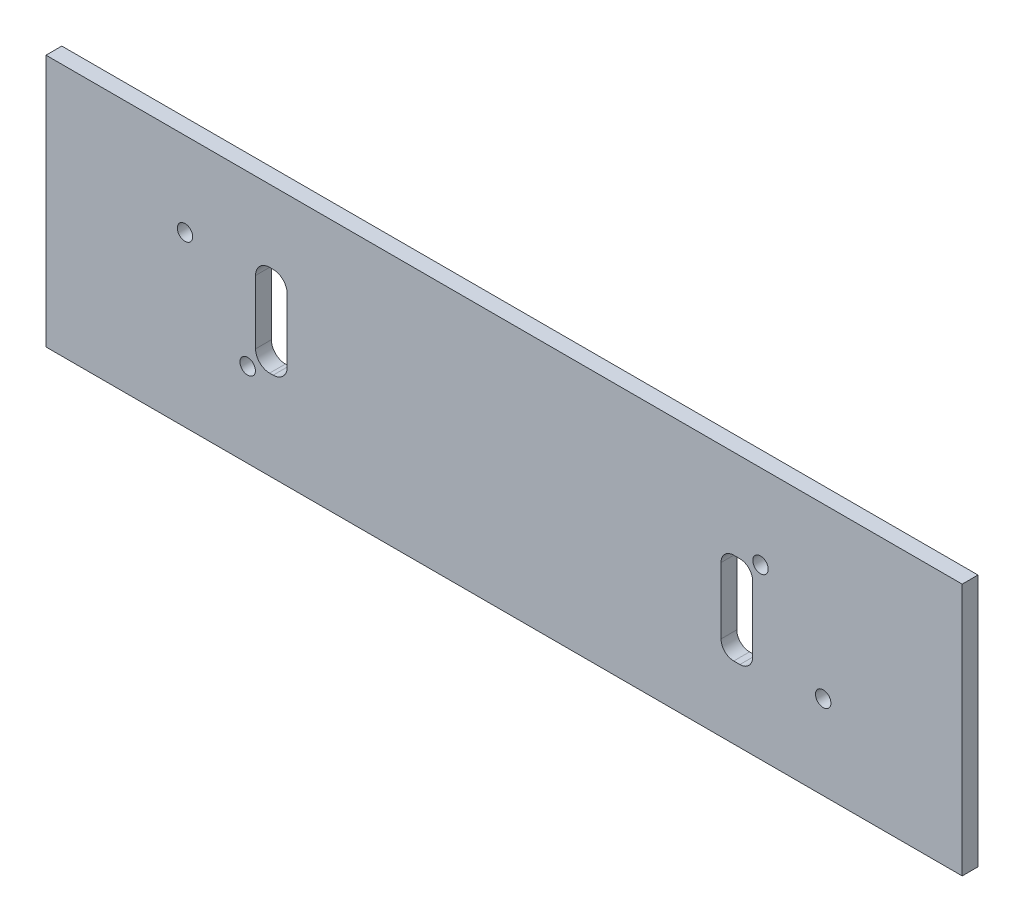
ISO-10303-21;
HEADER;
FILE_DESCRIPTION(('STEP AP214'),'2;1');
FILE_NAME('part.step','',(''),(''),'','','');
FILE_SCHEMA(('AUTOMOTIVE_DESIGN { 1 0 10303 214 1 1 1 1 }'));
ENDSEC;
DATA;
#1=APPLICATION_CONTEXT('core data for automotive mechanical design processes');
#2=APPLICATION_PROTOCOL_DEFINITION('international standard','automotive_design',2000,#1);
#3=PRODUCT_CONTEXT('',#1,'mechanical');
#4=PRODUCT('Part','Part','',(#3));
#5=PRODUCT_RELATED_PRODUCT_CATEGORY('part','',(#4));
#6=PRODUCT_DEFINITION_FORMATION('','',#4);
#7=PRODUCT_DEFINITION_CONTEXT('part definition',#1,'design');
#8=PRODUCT_DEFINITION('design','',#6,#7);
#9=PRODUCT_DEFINITION_SHAPE('','',#8);
#10=(LENGTH_UNIT() NAMED_UNIT(*) SI_UNIT(.MILLI.,.METRE.));
#11=(NAMED_UNIT(*) PLANE_ANGLE_UNIT() SI_UNIT($,.RADIAN.));
#12=(NAMED_UNIT(*) SI_UNIT($,.STERADIAN.) SOLID_ANGLE_UNIT());
#13=UNCERTAINTY_MEASURE_WITH_UNIT(LENGTH_MEASURE(1.E-05),#10,'distance_accuracy_value','');
#14=(GEOMETRIC_REPRESENTATION_CONTEXT(3) GLOBAL_UNCERTAINTY_ASSIGNED_CONTEXT((#13)) GLOBAL_UNIT_ASSIGNED_CONTEXT((#10,
#11,#12)) REPRESENTATION_CONTEXT('',''));
#15=CARTESIAN_POINT('',(0.,0.,0.));
#16=DIRECTION('',(0.,0.,1.));
#17=DIRECTION('',(1.,0.,0.));
#18=AXIS2_PLACEMENT_3D('',#15,#16,#17);
#19=CARTESIAN_POINT('',(92.075,-25.4,1.5875));
#20=DIRECTION('',(-1.,0.,0.));
#21=DIRECTION('',(0.,0.,1.));
#22=AXIS2_PLACEMENT_3D('',#19,#20,#21);
#23=PLANE('',#22);
#24=DIRECTION('',(0.,1.,0.));
#25=VECTOR('',#24,1.);
#26=CARTESIAN_POINT('',(92.075,-25.4,-1.5875));
#27=LINE('',#26,#25);
#28=CARTESIAN_POINT('',(92.075,-25.4,-1.5875));
#29=VERTEX_POINT('',#28);
#30=CARTESIAN_POINT('',(92.075,25.4,-1.5875));
#31=VERTEX_POINT('',#30);
#32=EDGE_CURVE('E330',#29,#31,#27,.T.);
#33=ORIENTED_EDGE('',*,*,#32,.T.);
#34=DIRECTION('',(0.,0.,-1.));
#35=VECTOR('',#34,1.);
#36=CARTESIAN_POINT('',(92.075,25.4,1.5875));
#37=LINE('',#36,#35);
#38=CARTESIAN_POINT('',(92.075,25.4,1.5875));
#39=VERTEX_POINT('',#38);
#40=EDGE_CURVE('E11',#39,#31,#37,.T.);
#41=ORIENTED_EDGE('',*,*,#40,.F.);
#42=DIRECTION('',(0.,1.,0.));
#43=VECTOR('',#42,1.);
#44=CARTESIAN_POINT('',(92.075,-25.4,1.5875));
#45=LINE('',#44,#43);
#46=CARTESIAN_POINT('',(92.075,-25.4,1.5875));
#47=VERTEX_POINT('',#46);
#48=EDGE_CURVE('E331',#47,#39,#45,.T.);
#49=ORIENTED_EDGE('',*,*,#48,.F.);
#50=DIRECTION('',(0.,0.,-1.));
#51=VECTOR('',#50,1.);
#52=CARTESIAN_POINT('',(92.075,-25.4,1.5875));
#53=LINE('',#52,#51);
#54=EDGE_CURVE('E341',#47,#29,#53,.T.);
#55=ORIENTED_EDGE('',*,*,#54,.T.);
#56=EDGE_LOOP('',(#33,#41,#49,#55));
#57=FACE_BOUND('',#56,.T.);
#58=ADVANCED_FACE('F35',(#57),#23,.F.);
#59=CARTESIAN_POINT('',(-92.075,25.4,1.5875));
#60=DIRECTION('',(0.,-1.,0.));
#61=DIRECTION('',(0.,0.,-1.));
#62=AXIS2_PLACEMENT_3D('',#59,#60,#61);
#63=PLANE('',#62);
#64=DIRECTION('',(-1.,0.,0.));
#65=VECTOR('',#64,1.);
#66=CARTESIAN_POINT('',(-92.075,25.4,-1.5875));
#67=LINE('',#66,#65);
#68=CARTESIAN_POINT('',(-92.075,25.4,-1.5875));
#69=VERTEX_POINT('',#68);
#70=EDGE_CURVE('E344',#31,#69,#67,.T.);
#71=ORIENTED_EDGE('',*,*,#70,.T.);
#72=DIRECTION('',(0.,0.,-1.));
#73=VECTOR('',#72,1.);
#74=CARTESIAN_POINT('',(-92.075,25.4,1.5875));
#75=LINE('',#74,#73);
#76=CARTESIAN_POINT('',(-92.075,25.4,1.5875));
#77=VERTEX_POINT('',#76);
#78=EDGE_CURVE('E42',#77,#69,#75,.T.);
#79=ORIENTED_EDGE('',*,*,#78,.F.);
#80=DIRECTION('',(-1.,0.,0.));
#81=VECTOR('',#80,1.);
#82=CARTESIAN_POINT('',(-92.075,25.4,1.5875));
#83=LINE('',#82,#81);
#84=EDGE_CURVE('E334',#39,#77,#83,.T.);
#85=ORIENTED_EDGE('',*,*,#84,.F.);
#86=ORIENTED_EDGE('',*,*,#40,.T.);
#87=EDGE_LOOP('',(#71,#79,#85,#86));
#88=FACE_BOUND('',#87,.T.);
#89=ADVANCED_FACE('F373',(#88),#63,.F.);
#90=CARTESIAN_POINT('',(-92.075,-25.4,1.5875));
#91=DIRECTION('',(1.,0.,0.));
#92=DIRECTION('',(0.,0.,-1.));
#93=AXIS2_PLACEMENT_3D('',#90,#91,#92);
#94=PLANE('',#93);
#95=DIRECTION('',(0.,-1.,0.));
#96=VECTOR('',#95,1.);
#97=CARTESIAN_POINT('',(-92.075,-25.4,-1.5875));
#98=LINE('',#97,#96);
#99=CARTESIAN_POINT('',(-92.075,-25.4,-1.5875));
#100=VERTEX_POINT('',#99);
#101=EDGE_CURVE('E346',#69,#100,#98,.T.);
#102=ORIENTED_EDGE('',*,*,#101,.T.);
#103=DIRECTION('',(0.,0.,-1.));
#104=VECTOR('',#103,1.);
#105=CARTESIAN_POINT('',(-92.075,-25.4,1.5875));
#106=LINE('',#105,#104);
#107=CARTESIAN_POINT('',(-92.075,-25.4,1.5875));
#108=VERTEX_POINT('',#107);
#109=EDGE_CURVE('E351',#108,#100,#106,.T.);
#110=ORIENTED_EDGE('',*,*,#109,.F.);
#111=DIRECTION('',(0.,-1.,0.));
#112=VECTOR('',#111,1.);
#113=CARTESIAN_POINT('',(-92.075,-25.4,1.5875));
#114=LINE('',#113,#112);
#115=EDGE_CURVE('E337',#77,#108,#114,.T.);
#116=ORIENTED_EDGE('',*,*,#115,.F.);
#117=ORIENTED_EDGE('',*,*,#78,.T.);
#118=EDGE_LOOP('',(#102,#110,#116,#117));
#119=FACE_BOUND('',#118,.T.);
#120=ADVANCED_FACE('F358',(#119),#94,.F.);
#121=CARTESIAN_POINT('',(-92.075,-25.4,1.5875));
#122=DIRECTION('',(0.,1.,0.));
#123=DIRECTION('',(0.,0.,1.));
#124=AXIS2_PLACEMENT_3D('',#121,#122,#123);
#125=PLANE('',#124);
#126=DIRECTION('',(1.,0.,0.));
#127=VECTOR('',#126,1.);
#128=CARTESIAN_POINT('',(-92.075,-25.4,-1.5875));
#129=LINE('',#128,#127);
#130=EDGE_CURVE('E335',#100,#29,#129,.T.);
#131=ORIENTED_EDGE('',*,*,#130,.T.);
#132=ORIENTED_EDGE('',*,*,#54,.F.);
#133=DIRECTION('',(1.,0.,0.));
#134=VECTOR('',#133,1.);
#135=CARTESIAN_POINT('',(-92.075,-25.4,1.5875));
#136=LINE('',#135,#134);
#137=EDGE_CURVE('E339',#108,#47,#136,.T.);
#138=ORIENTED_EDGE('',*,*,#137,.F.);
#139=ORIENTED_EDGE('',*,*,#109,.T.);
#140=EDGE_LOOP('',(#131,#132,#138,#139));
#141=FACE_BOUND('',#140,.T.);
#142=ADVANCED_FACE('F366',(#141),#125,.F.);
#143=CARTESIAN_POINT('',(0.,0.,1.5875));
#144=DIRECTION('',(0.,0.,-1.));
#145=DIRECTION('',(-1.,0.,0.));
#146=AXIS2_PLACEMENT_3D('',#143,#144,#145);
#147=PLANE('',#146);
#148=DIRECTION('',(0.,-1.,0.));
#149=VECTOR('',#148,1.);
#150=CARTESIAN_POINT('',(49.95,0.,1.5875));
#151=LINE('',#150,#149);
#152=CARTESIAN_POINT('',(49.95,4.91823249157205,1.5875));
#153=VERTEX_POINT('',#152);
#154=CARTESIAN_POINT('',(49.95,-8.37823249157208,1.5875));
#155=VERTEX_POINT('',#154);
#156=EDGE_CURVE('E324',#153,#155,#151,.T.);
#157=ORIENTED_EDGE('',*,*,#156,.T.);
#158=CARTESIAN_POINT('',(47.3907324915721,-8.37823249157208,1.5875));
#159=DIRECTION('',(0.,0.,-1.));
#160=DIRECTION('',(-1.,0.,0.));
#161=AXIS2_PLACEMENT_3D('',#158,#159,#160);
#162=CIRCLE('',#161,2.55926750842794);
#163=CARTESIAN_POINT('',(47.3907324915721,-10.9375,1.5875));
#164=VERTEX_POINT('',#163);
#165=EDGE_CURVE('E327',#155,#164,#162,.T.);
#166=ORIENTED_EDGE('',*,*,#165,.T.);
#167=DIRECTION('',(-1.,0.,0.));
#168=VECTOR('',#167,1.);
#169=CARTESIAN_POINT('',(0.,-10.9375,1.5875));
#170=LINE('',#169,#168);
#171=CARTESIAN_POINT('',(46.159267508428,-10.9375,1.5875));
#172=VERTEX_POINT('',#171);
#173=EDGE_CURVE('E306',#164,#172,#170,.T.);
#174=ORIENTED_EDGE('',*,*,#173,.T.);
#175=CARTESIAN_POINT('',(46.159267508428,-8.37823249157208,1.5875));
#176=DIRECTION('',(0.,0.,-1.));
#177=DIRECTION('',(-1.,0.,0.));
#178=AXIS2_PLACEMENT_3D('',#175,#176,#177);
#179=CIRCLE('',#178,2.55926750842794);
#180=CARTESIAN_POINT('',(43.6,-8.37823249157208,1.5875));
#181=VERTEX_POINT('',#180);
#182=EDGE_CURVE('E309',#172,#181,#179,.T.);
#183=ORIENTED_EDGE('',*,*,#182,.T.);
#184=DIRECTION('',(0.,1.,0.));
#185=VECTOR('',#184,1.);
#186=CARTESIAN_POINT('',(43.6,0.,1.5875));
#187=LINE('',#186,#185);
#188=CARTESIAN_POINT('',(43.6,4.91823249157205,1.5875));
#189=VERTEX_POINT('',#188);
#190=EDGE_CURVE('E312',#181,#189,#187,.T.);
#191=ORIENTED_EDGE('',*,*,#190,.T.);
#192=CARTESIAN_POINT('',(46.159267508428,4.91823249157205,1.5875));
#193=DIRECTION('',(0.,0.,-1.));
#194=DIRECTION('',(-1.,0.,0.));
#195=AXIS2_PLACEMENT_3D('',#192,#193,#194);
#196=CIRCLE('',#195,2.55926750842794);
#197=CARTESIAN_POINT('',(46.159267508428,7.47749999999998,1.5875));
#198=VERTEX_POINT('',#197);
#199=EDGE_CURVE('E315',#189,#198,#196,.T.);
#200=ORIENTED_EDGE('',*,*,#199,.T.);
#201=DIRECTION('',(1.,0.,0.));
#202=VECTOR('',#201,1.);
#203=CARTESIAN_POINT('',(0.,7.47749999999998,1.5875));
#204=LINE('',#203,#202);
#205=CARTESIAN_POINT('',(47.3907324915721,7.47749999999998,1.5875));
#206=VERTEX_POINT('',#205);
#207=EDGE_CURVE('E318',#198,#206,#204,.T.);
#208=ORIENTED_EDGE('',*,*,#207,.T.);
#209=CARTESIAN_POINT('',(47.3907324915721,4.91823249157205,1.5875));
#210=DIRECTION('',(0.,0.,-1.));
#211=DIRECTION('',(-1.,0.,0.));
#212=AXIS2_PLACEMENT_3D('',#209,#210,#211);
#213=CIRCLE('',#212,2.55926750842794);
#214=EDGE_CURVE('E321',#206,#153,#213,.T.);
#215=ORIENTED_EDGE('',*,*,#214,.T.);
#216=EDGE_LOOP('',(#157,#166,#174,#183,#191,#200,#208,#215));
#217=FACE_BOUND('',#216,.T.);
#218=CARTESIAN_POINT('',(-51.535,-8.49,1.5875));
#219=DIRECTION('',(0.,0.,-1.));
#220=DIRECTION('',(-1.,0.,0.));
#221=AXIS2_PLACEMENT_3D('',#218,#219,#220);
#222=CIRCLE('',#221,1.55);
#223=CARTESIAN_POINT('',(-53.085,-8.49,1.5875));
#224=VERTEX_POINT('',#223);
#225=EDGE_CURVE('E303',#224,#224,#222,.T.);
#226=ORIENTED_EDGE('',*,*,#225,.T.);
#227=EDGE_LOOP('',(#226));
#228=FACE_BOUND('',#227,.T.);
#229=CARTESIAN_POINT('',(-64.135,8.51,1.5875));
#230=DIRECTION('',(0.,0.,-1.));
#231=DIRECTION('',(-1.,0.,0.));
#232=AXIS2_PLACEMENT_3D('',#229,#230,#231);
#233=CIRCLE('',#232,1.55000000000001);
#234=CARTESIAN_POINT('',(-65.685,8.51,1.5875));
#235=VERTEX_POINT('',#234);
#236=EDGE_CURVE('E300',#235,#235,#233,.T.);
#237=ORIENTED_EDGE('',*,*,#236,.T.);
#238=EDGE_LOOP('',(#237));
#239=FACE_BOUND('',#238,.T.);
#240=CARTESIAN_POINT('',(64.135,-8.51000000000002,1.5875));
#241=DIRECTION('',(0.,0.,-1.));
#242=DIRECTION('',(-1.,0.,0.));
#243=AXIS2_PLACEMENT_3D('',#240,#241,#242);
#244=CIRCLE('',#243,1.55000000000001);
#245=CARTESIAN_POINT('',(62.585,-8.51000000000002,1.5875));
#246=VERTEX_POINT('',#245);
#247=EDGE_CURVE('E297',#246,#246,#244,.T.);
#248=ORIENTED_EDGE('',*,*,#247,.T.);
#249=EDGE_LOOP('',(#248));
#250=FACE_BOUND('',#249,.T.);
#251=DIRECTION('',(0.,-1.,0.));
#252=VECTOR('',#251,1.);
#253=CARTESIAN_POINT('',(-43.6,0.,1.5875));
#254=LINE('',#253,#252);
#255=CARTESIAN_POINT('',(-43.6,8.11818153718454,1.5875));
#256=VERTEX_POINT('',#255);
#257=CARTESIAN_POINT('',(-43.6,-4.65818153718455,1.5875));
#258=VERTEX_POINT('',#257);
#259=EDGE_CURVE('E291',#256,#258,#254,.T.);
#260=ORIENTED_EDGE('',*,*,#259,.T.);
#261=CARTESIAN_POINT('',(-46.4193184628155,-4.65818153718455,1.5875));
#262=DIRECTION('',(0.,0.,-1.));
#263=DIRECTION('',(-1.,0.,0.));
#264=AXIS2_PLACEMENT_3D('',#261,#262,#263);
#265=CIRCLE('',#264,2.81931846281545);
#266=CARTESIAN_POINT('',(-46.4193184628155,-7.47750000000001,1.5875));
#267=VERTEX_POINT('',#266);
#268=EDGE_CURVE('E294',#258,#267,#265,.T.);
#269=ORIENTED_EDGE('',*,*,#268,.T.);
#270=DIRECTION('',(-1.,0.,0.));
#271=VECTOR('',#270,1.);
#272=CARTESIAN_POINT('',(0.,-7.47750000000001,1.5875));
#273=LINE('',#272,#271);
#274=CARTESIAN_POINT('',(-47.1306815371846,-7.47750000000001,1.5875));
#275=VERTEX_POINT('',#274);
#276=EDGE_CURVE('E276',#267,#275,#273,.T.);
#277=ORIENTED_EDGE('',*,*,#276,.T.);
#278=CARTESIAN_POINT('',(-47.1306815371846,-4.65818153718455,1.5875));
#279=DIRECTION('',(0.,0.,-1.));
#280=DIRECTION('',(-1.,0.,0.));
#281=AXIS2_PLACEMENT_3D('',#278,#279,#280);
#282=CIRCLE('',#281,2.81931846281545);
#283=CARTESIAN_POINT('',(-49.95,-4.65818153718455,1.5875));
#284=VERTEX_POINT('',#283);
#285=EDGE_CURVE('E176',#275,#284,#282,.T.);
#286=ORIENTED_EDGE('',*,*,#285,.T.);
#287=DIRECTION('',(0.,1.,0.));
#288=VECTOR('',#287,1.);
#289=CARTESIAN_POINT('',(-49.95,0.,1.5875));
#290=LINE('',#289,#288);
#291=CARTESIAN_POINT('',(-49.95,8.11818153718454,1.5875));
#292=VERTEX_POINT('',#291);
#293=EDGE_CURVE('E279',#284,#292,#290,.T.);
#294=ORIENTED_EDGE('',*,*,#293,.T.);
#295=CARTESIAN_POINT('',(-47.1306815371846,8.11818153718454,1.5875));
#296=DIRECTION('',(0.,0.,-1.));
#297=DIRECTION('',(-1.,0.,0.));
#298=AXIS2_PLACEMENT_3D('',#295,#296,#297);
#299=CIRCLE('',#298,2.81931846281545);
#300=CARTESIAN_POINT('',(-47.1306815371846,10.9375,1.5875));
#301=VERTEX_POINT('',#300);
#302=EDGE_CURVE('E282',#292,#301,#299,.T.);
#303=ORIENTED_EDGE('',*,*,#302,.T.);
#304=DIRECTION('',(1.,0.,0.));
#305=VECTOR('',#304,1.);
#306=CARTESIAN_POINT('',(0.,10.9375,1.5875));
#307=LINE('',#306,#305);
#308=CARTESIAN_POINT('',(-46.4193184628155,10.9375,1.5875));
#309=VERTEX_POINT('',#308);
#310=EDGE_CURVE('E285',#301,#309,#307,.T.);
#311=ORIENTED_EDGE('',*,*,#310,.T.);
#312=CARTESIAN_POINT('',(-46.4193184628155,8.11818153718454,1.5875));
#313=DIRECTION('',(0.,0.,-1.));
#314=DIRECTION('',(-1.,0.,0.));
#315=AXIS2_PLACEMENT_3D('',#312,#313,#314);
#316=CIRCLE('',#315,2.81931846281545);
#317=EDGE_CURVE('E288',#309,#256,#316,.T.);
#318=ORIENTED_EDGE('',*,*,#317,.T.);
#319=EDGE_LOOP('',(#260,#269,#277,#286,#294,#303,#311,#318));
#320=FACE_BOUND('',#319,.T.);
#321=CARTESIAN_POINT('',(51.535,8.48999999999998,1.5875));
#322=DIRECTION('',(0.,0.,-1.));
#323=DIRECTION('',(-1.,0.,0.));
#324=AXIS2_PLACEMENT_3D('',#321,#322,#323);
#325=CIRCLE('',#324,1.55);
#326=CARTESIAN_POINT('',(49.985,8.48999999999998,1.5875));
#327=VERTEX_POINT('',#326);
#328=EDGE_CURVE('E273',#327,#327,#325,.T.);
#329=ORIENTED_EDGE('',*,*,#328,.T.);
#330=EDGE_LOOP('',(#329));
#331=FACE_BOUND('',#330,.T.);
#332=ORIENTED_EDGE('',*,*,#48,.T.);
#333=ORIENTED_EDGE('',*,*,#84,.T.);
#334=ORIENTED_EDGE('',*,*,#115,.T.);
#335=ORIENTED_EDGE('',*,*,#137,.T.);
#336=EDGE_LOOP('',(#332,#333,#334,#335));
#337=FACE_BOUND('',#336,.T.);
#338=ADVANCED_FACE('F372',(#217,#228,#239,#250,#320,#331,#337),#147,.F.);
#339=CARTESIAN_POINT('',(0.,0.,-1.5875));
#340=DIRECTION('',(0.,0.,-1.));
#341=DIRECTION('',(-1.,0.,0.));
#342=AXIS2_PLACEMENT_3D('',#339,#340,#341);
#343=PLANE('',#342);
#344=CARTESIAN_POINT('',(47.3907324915721,-8.37823249157208,-1.5875));
#345=DIRECTION('',(0.,0.,-1.));
#346=DIRECTION('',(1.,0.,0.));
#347=AXIS2_PLACEMENT_3D('',#344,#345,#346);
#348=CIRCLE('',#347,2.55926750842794);
#349=CARTESIAN_POINT('',(49.95,-8.37823249157208,-1.5875));
#350=VERTEX_POINT('',#349);
#351=CARTESIAN_POINT('',(47.3907324915721,-10.9375,-1.5875));
#352=VERTEX_POINT('',#351);
#353=EDGE_CURVE('E213',#350,#352,#348,.T.);
#354=ORIENTED_EDGE('',*,*,#353,.F.);
#355=DIRECTION('',(0.,-1.,0.));
#356=VECTOR('',#355,1.);
#357=CARTESIAN_POINT('',(49.95,-8.37823249157208,-1.5875));
#358=LINE('',#357,#356);
#359=CARTESIAN_POINT('',(49.95,4.91823249157205,-1.5875));
#360=VERTEX_POINT('',#359);
#361=EDGE_CURVE('E247',#360,#350,#358,.T.);
#362=ORIENTED_EDGE('',*,*,#361,.F.);
#363=CARTESIAN_POINT('',(47.3907324915721,4.91823249157205,-1.5875));
#364=DIRECTION('',(0.,0.,-1.));
#365=DIRECTION('',(-1.,0.,0.));
#366=AXIS2_PLACEMENT_3D('',#363,#364,#365);
#367=CIRCLE('',#366,2.55926750842794);
#368=CARTESIAN_POINT('',(47.3907324915721,7.47749999999998,-1.5875));
#369=VERTEX_POINT('',#368);
#370=EDGE_CURVE('E244',#369,#360,#367,.T.);
#371=ORIENTED_EDGE('',*,*,#370,.F.);
#372=DIRECTION('',(1.,0.,0.));
#373=VECTOR('',#372,1.);
#374=CARTESIAN_POINT('',(46.159267508428,7.47749999999998,-1.5875));
#375=LINE('',#374,#373);
#376=CARTESIAN_POINT('',(46.159267508428,7.47749999999998,-1.5875));
#377=VERTEX_POINT('',#376);
#378=EDGE_CURVE('E241',#377,#369,#375,.T.);
#379=ORIENTED_EDGE('',*,*,#378,.F.);
#380=CARTESIAN_POINT('',(46.159267508428,4.91823249157205,-1.5875));
#381=DIRECTION('',(0.,0.,-1.));
#382=DIRECTION('',(1.,0.,0.));
#383=AXIS2_PLACEMENT_3D('',#380,#381,#382);
#384=CIRCLE('',#383,2.55926750842794);
#385=CARTESIAN_POINT('',(43.6,4.91823249157205,-1.5875));
#386=VERTEX_POINT('',#385);
#387=EDGE_CURVE('E238',#386,#377,#384,.T.);
#388=ORIENTED_EDGE('',*,*,#387,.F.);
#389=DIRECTION('',(0.,1.,0.));
#390=VECTOR('',#389,1.);
#391=CARTESIAN_POINT('',(43.6,-8.37823249157208,-1.5875));
#392=LINE('',#391,#390);
#393=CARTESIAN_POINT('',(43.6,-8.37823249157208,-1.5875));
#394=VERTEX_POINT('',#393);
#395=EDGE_CURVE('E235',#394,#386,#392,.T.);
#396=ORIENTED_EDGE('',*,*,#395,.F.);
#397=CARTESIAN_POINT('',(46.159267508428,-8.37823249157208,-1.5875));
#398=DIRECTION('',(0.,0.,-1.));
#399=DIRECTION('',(-1.,0.,0.));
#400=AXIS2_PLACEMENT_3D('',#397,#398,#399);
#401=CIRCLE('',#400,2.55926750842794);
#402=CARTESIAN_POINT('',(46.159267508428,-10.9375,-1.5875));
#403=VERTEX_POINT('',#402);
#404=EDGE_CURVE('E232',#403,#394,#401,.T.);
#405=ORIENTED_EDGE('',*,*,#404,.F.);
#406=DIRECTION('',(-1.,0.,0.));
#407=VECTOR('',#406,1.);
#408=CARTESIAN_POINT('',(46.159267508428,-10.9375,-1.5875));
#409=LINE('',#408,#407);
#410=EDGE_CURVE('E230',#352,#403,#409,.T.);
#411=ORIENTED_EDGE('',*,*,#410,.F.);
#412=EDGE_LOOP('',(#354,#362,#371,#379,#388,#396,#405,#411));
#413=FACE_BOUND('',#412,.T.);
#414=CARTESIAN_POINT('',(-51.535,-8.49,-1.5875));
#415=DIRECTION('',(0.,0.,-1.));
#416=DIRECTION('',(-1.,0.,0.));
#417=AXIS2_PLACEMENT_3D('',#414,#415,#416);
#418=CIRCLE('',#417,1.55);
#419=CARTESIAN_POINT('',(-53.085,-8.49,-1.5875));
#420=VERTEX_POINT('',#419);
#421=EDGE_CURVE('E224',#420,#420,#418,.T.);
#422=ORIENTED_EDGE('',*,*,#421,.F.);
#423=EDGE_LOOP('',(#422));
#424=FACE_BOUND('',#423,.T.);
#425=CARTESIAN_POINT('',(-64.135,8.51,-1.5875));
#426=DIRECTION('',(0.,0.,-1.));
#427=DIRECTION('',(-1.,0.,0.));
#428=AXIS2_PLACEMENT_3D('',#425,#426,#427);
#429=CIRCLE('',#428,1.55000000000001);
#430=CARTESIAN_POINT('',(-65.685,8.51,-1.5875));
#431=VERTEX_POINT('',#430);
#432=EDGE_CURVE('E227',#431,#431,#429,.T.);
#433=ORIENTED_EDGE('',*,*,#432,.F.);
#434=EDGE_LOOP('',(#433));
#435=FACE_BOUND('',#434,.T.);
#436=CARTESIAN_POINT('',(64.135,-8.51000000000002,-1.5875));
#437=DIRECTION('',(0.,0.,-1.));
#438=DIRECTION('',(-1.,0.,0.));
#439=AXIS2_PLACEMENT_3D('',#436,#437,#438);
#440=CIRCLE('',#439,1.55000000000001);
#441=CARTESIAN_POINT('',(62.585,-8.51000000000002,-1.5875));
#442=VERTEX_POINT('',#441);
#443=EDGE_CURVE('E265',#442,#442,#440,.T.);
#444=ORIENTED_EDGE('',*,*,#443,.F.);
#445=EDGE_LOOP('',(#444));
#446=FACE_BOUND('',#445,.T.);
#447=CARTESIAN_POINT('',(-46.4193184628155,-4.65818153718455,-1.5875));
#448=DIRECTION('',(0.,0.,-1.));
#449=DIRECTION('',(1.,0.,0.));
#450=AXIS2_PLACEMENT_3D('',#447,#448,#449);
#451=CIRCLE('',#450,2.81931846281545);
#452=CARTESIAN_POINT('',(-43.6,-4.65818153718455,-1.5875));
#453=VERTEX_POINT('',#452);
#454=CARTESIAN_POINT('',(-46.4193184628155,-7.47750000000001,-1.5875));
#455=VERTEX_POINT('',#454);
#456=EDGE_CURVE('E188',#453,#455,#451,.T.);
#457=ORIENTED_EDGE('',*,*,#456,.F.);
#458=DIRECTION('',(0.,-1.,0.));
#459=VECTOR('',#458,1.);
#460=CARTESIAN_POINT('',(-43.6,-4.65818153718455,-1.5875));
#461=LINE('',#460,#459);
#462=CARTESIAN_POINT('',(-43.6,8.11818153718454,-1.5875));
#463=VERTEX_POINT('',#462);
#464=EDGE_CURVE('E208',#463,#453,#461,.T.);
#465=ORIENTED_EDGE('',*,*,#464,.F.);
#466=CARTESIAN_POINT('',(-46.4193184628155,8.11818153718454,-1.5875));
#467=DIRECTION('',(0.,0.,-1.));
#468=DIRECTION('',(-1.,0.,0.));
#469=AXIS2_PLACEMENT_3D('',#466,#467,#468);
#470=CIRCLE('',#469,2.81931846281545);
#471=CARTESIAN_POINT('',(-46.4193184628155,10.9375,-1.5875));
#472=VERTEX_POINT('',#471);
#473=EDGE_CURVE('E205',#472,#463,#470,.T.);
#474=ORIENTED_EDGE('',*,*,#473,.F.);
#475=DIRECTION('',(1.,0.,0.));
#476=VECTOR('',#475,1.);
#477=CARTESIAN_POINT('',(-46.4193184628155,10.9375,-1.5875));
#478=LINE('',#477,#476);
#479=CARTESIAN_POINT('',(-47.1306815371846,10.9375,-1.5875));
#480=VERTEX_POINT('',#479);
#481=EDGE_CURVE('E202',#480,#472,#478,.T.);
#482=ORIENTED_EDGE('',*,*,#481,.F.);
#483=CARTESIAN_POINT('',(-47.1306815371846,8.11818153718454,-1.5875));
#484=DIRECTION('',(0.,0.,-1.));
#485=DIRECTION('',(1.,0.,0.));
#486=AXIS2_PLACEMENT_3D('',#483,#484,#485);
#487=CIRCLE('',#486,2.81931846281545);
#488=CARTESIAN_POINT('',(-49.95,8.11818153718454,-1.5875));
#489=VERTEX_POINT('',#488);
#490=EDGE_CURVE('E196',#489,#480,#487,.T.);
#491=ORIENTED_EDGE('',*,*,#490,.F.);
#492=DIRECTION('',(0.,1.,0.));
#493=VECTOR('',#492,1.);
#494=CARTESIAN_POINT('',(-49.95,-4.65818153718455,-1.5875));
#495=LINE('',#494,#493);
#496=CARTESIAN_POINT('',(-49.95,-4.65818153718455,-1.5875));
#497=VERTEX_POINT('',#496);
#498=EDGE_CURVE('E194',#497,#489,#495,.T.);
#499=ORIENTED_EDGE('',*,*,#498,.F.);
#500=CARTESIAN_POINT('',(-47.1306815371846,-4.65818153718455,-1.5875));
#501=DIRECTION('',(0.,0.,-1.));
#502=DIRECTION('',(-1.,0.,0.));
#503=AXIS2_PLACEMENT_3D('',#500,#501,#502);
#504=CIRCLE('',#503,2.81931846281545);
#505=CARTESIAN_POINT('',(-47.1306815371846,-7.47750000000001,-1.5875));
#506=VERTEX_POINT('',#505);
#507=EDGE_CURVE('E173',#506,#497,#504,.T.);
#508=ORIENTED_EDGE('',*,*,#507,.F.);
#509=DIRECTION('',(-1.,0.,0.));
#510=VECTOR('',#509,1.);
#511=CARTESIAN_POINT('',(-46.4193184628155,-7.47750000000001,-1.5875));
#512=LINE('',#511,#510);
#513=EDGE_CURVE('E183',#455,#506,#512,.T.);
#514=ORIENTED_EDGE('',*,*,#513,.F.);
#515=EDGE_LOOP('',(#457,#465,#474,#482,#491,#499,#508,#514));
#516=FACE_BOUND('',#515,.T.);
#517=CARTESIAN_POINT('',(51.535,8.48999999999998,-1.5875));
#518=DIRECTION('',(0.,0.,-1.));
#519=DIRECTION('',(-1.,0.,0.));
#520=AXIS2_PLACEMENT_3D('',#517,#518,#519);
#521=CIRCLE('',#520,1.55);
#522=CARTESIAN_POINT('',(49.985,8.48999999999998,-1.5875));
#523=VERTEX_POINT('',#522);
#524=EDGE_CURVE('E268',#523,#523,#521,.T.);
#525=ORIENTED_EDGE('',*,*,#524,.F.);
#526=EDGE_LOOP('',(#525));
#527=FACE_BOUND('',#526,.T.);
#528=ORIENTED_EDGE('',*,*,#32,.F.);
#529=ORIENTED_EDGE('',*,*,#130,.F.);
#530=ORIENTED_EDGE('',*,*,#101,.F.);
#531=ORIENTED_EDGE('',*,*,#70,.F.);
#532=EDGE_LOOP('',(#528,#529,#530,#531));
#533=FACE_BOUND('',#532,.T.);
#534=ADVANCED_FACE('F190',(#413,#424,#435,#446,#516,#527,#533),#343,.T.);
#535=CARTESIAN_POINT('',(51.535,8.48999999999998,3.4925));
#536=DIRECTION('',(0.,0.,-1.));
#537=DIRECTION('',(-1.,0.,0.));
#538=AXIS2_PLACEMENT_3D('',#535,#536,#537);
#539=CYLINDRICAL_SURFACE('',#538,1.55);
#540=ORIENTED_EDGE('',*,*,#524,.T.);
#541=EDGE_LOOP('',(#540));
#542=FACE_BOUND('',#541,.T.);
#543=ORIENTED_EDGE('',*,*,#328,.F.);
#544=EDGE_LOOP('',(#543));
#545=FACE_BOUND('',#544,.T.);
#546=ADVANCED_FACE('F385',(#542,#545),#539,.F.);
#547=CARTESIAN_POINT('',(-46.4193184628155,-4.65818153718455,3.4925));
#548=DIRECTION('',(0.,0.,-1.));
#549=DIRECTION('',(-1.,0.,0.));
#550=AXIS2_PLACEMENT_3D('',#547,#548,#549);
#551=CYLINDRICAL_SURFACE('',#550,2.81931846281545);
#552=DIRECTION('',(0.,0.,-1.));
#553=VECTOR('',#552,1.);
#554=CARTESIAN_POINT('',(-43.6,-4.65818153718455,3.4925));
#555=LINE('',#554,#553);
#556=EDGE_CURVE('E211',#258,#453,#555,.T.);
#557=ORIENTED_EDGE('',*,*,#556,.T.);
#558=ORIENTED_EDGE('',*,*,#456,.T.);
#559=DIRECTION('',(0.,0.,-1.));
#560=VECTOR('',#559,1.);
#561=CARTESIAN_POINT('',(-46.4193184628155,-7.47750000000001,3.4925));
#562=LINE('',#561,#560);
#563=EDGE_CURVE('E179',#267,#455,#562,.T.);
#564=ORIENTED_EDGE('',*,*,#563,.F.);
#565=ORIENTED_EDGE('',*,*,#268,.F.);
#566=EDGE_LOOP('',(#557,#558,#564,#565));
#567=FACE_BOUND('',#566,.T.);
#568=ADVANCED_FACE('F392',(#567),#551,.F.);
#569=CARTESIAN_POINT('',(-43.6,-4.65818153718455,3.4925));
#570=DIRECTION('',(1.,0.,0.));
#571=DIRECTION('',(0.,0.,-1.));
#572=AXIS2_PLACEMENT_3D('',#569,#570,#571);
#573=PLANE('',#572);
#574=DIRECTION('',(0.,0.,-1.));
#575=VECTOR('',#574,1.);
#576=CARTESIAN_POINT('',(-43.6,8.11818153718454,3.4925));
#577=LINE('',#576,#575);
#578=EDGE_CURVE('E214',#256,#463,#577,.T.);
#579=ORIENTED_EDGE('',*,*,#578,.T.);
#580=ORIENTED_EDGE('',*,*,#464,.T.);
#581=ORIENTED_EDGE('',*,*,#556,.F.);
#582=ORIENTED_EDGE('',*,*,#259,.F.);
#583=EDGE_LOOP('',(#579,#580,#581,#582));
#584=FACE_BOUND('',#583,.T.);
#585=ADVANCED_FACE('F439',(#584),#573,.F.);
#586=CARTESIAN_POINT('',(-46.4193184628155,8.11818153718454,3.4925));
#587=DIRECTION('',(0.,0.,-1.));
#588=DIRECTION('',(-1.,0.,0.));
#589=AXIS2_PLACEMENT_3D('',#586,#587,#588);
#590=CYLINDRICAL_SURFACE('',#589,2.81931846281545);
#591=DIRECTION('',(0.,0.,-1.));
#592=VECTOR('',#591,1.);
#593=CARTESIAN_POINT('',(-46.4193184628155,10.9375,3.4925));
#594=LINE('',#593,#592);
#595=EDGE_CURVE('E216',#309,#472,#594,.T.);
#596=ORIENTED_EDGE('',*,*,#595,.T.);
#597=ORIENTED_EDGE('',*,*,#473,.T.);
#598=ORIENTED_EDGE('',*,*,#578,.F.);
#599=ORIENTED_EDGE('',*,*,#317,.F.);
#600=EDGE_LOOP('',(#596,#597,#598,#599));
#601=FACE_BOUND('',#600,.T.);
#602=ADVANCED_FACE('F456',(#601),#590,.F.);
#603=CARTESIAN_POINT('',(-46.4193184628155,10.9375,3.4925));
#604=DIRECTION('',(0.,1.,0.));
#605=DIRECTION('',(0.,0.,1.));
#606=AXIS2_PLACEMENT_3D('',#603,#604,#605);
#607=PLANE('',#606);
#608=DIRECTION('',(0.,0.,-1.));
#609=VECTOR('',#608,1.);
#610=CARTESIAN_POINT('',(-47.1306815371846,10.9375,3.4925));
#611=LINE('',#610,#609);
#612=EDGE_CURVE('E218',#301,#480,#611,.T.);
#613=ORIENTED_EDGE('',*,*,#612,.T.);
#614=ORIENTED_EDGE('',*,*,#481,.T.);
#615=ORIENTED_EDGE('',*,*,#595,.F.);
#616=ORIENTED_EDGE('',*,*,#310,.F.);
#617=EDGE_LOOP('',(#613,#614,#615,#616));
#618=FACE_BOUND('',#617,.T.);
#619=ADVANCED_FACE('F452',(#618),#607,.F.);
#620=CARTESIAN_POINT('',(-47.1306815371846,8.11818153718454,3.4925));
#621=DIRECTION('',(0.,0.,-1.));
#622=DIRECTION('',(-1.,0.,0.));
#623=AXIS2_PLACEMENT_3D('',#620,#621,#622);
#624=CYLINDRICAL_SURFACE('',#623,2.81931846281545);
#625=DIRECTION('',(0.,0.,-1.));
#626=VECTOR('',#625,1.);
#627=CARTESIAN_POINT('',(-49.95,8.11818153718454,3.4925));
#628=LINE('',#627,#626);
#629=EDGE_CURVE('E220',#292,#489,#628,.T.);
#630=ORIENTED_EDGE('',*,*,#629,.T.);
#631=ORIENTED_EDGE('',*,*,#490,.T.);
#632=ORIENTED_EDGE('',*,*,#612,.F.);
#633=ORIENTED_EDGE('',*,*,#302,.F.);
#634=EDGE_LOOP('',(#630,#631,#632,#633));
#635=FACE_BOUND('',#634,.T.);
#636=ADVANCED_FACE('F448',(#635),#624,.F.);
#637=CARTESIAN_POINT('',(-49.95,-4.65818153718455,3.4925));
#638=DIRECTION('',(-1.,0.,0.));
#639=DIRECTION('',(0.,0.,1.));
#640=AXIS2_PLACEMENT_3D('',#637,#638,#639);
#641=PLANE('',#640);
#642=DIRECTION('',(0.,0.,-1.));
#643=VECTOR('',#642,1.);
#644=CARTESIAN_POINT('',(-49.95,-4.65818153718455,3.4925));
#645=LINE('',#644,#643);
#646=EDGE_CURVE('E178',#284,#497,#645,.T.);
#647=ORIENTED_EDGE('',*,*,#646,.T.);
#648=ORIENTED_EDGE('',*,*,#498,.T.);
#649=ORIENTED_EDGE('',*,*,#629,.F.);
#650=ORIENTED_EDGE('',*,*,#293,.F.);
#651=EDGE_LOOP('',(#647,#648,#649,#650));
#652=FACE_BOUND('',#651,.T.);
#653=ADVANCED_FACE('F445',(#652),#641,.F.);
#654=CARTESIAN_POINT('',(-47.1306815371846,-4.65818153718455,3.4925));
#655=DIRECTION('',(0.,0.,-1.));
#656=DIRECTION('',(-1.,0.,0.));
#657=AXIS2_PLACEMENT_3D('',#654,#655,#656);
#658=CYLINDRICAL_SURFACE('',#657,2.81931846281545);
#659=DIRECTION('',(0.,0.,-1.));
#660=VECTOR('',#659,1.);
#661=CARTESIAN_POINT('',(-47.1306815371846,-7.47750000000001,3.4925));
#662=LINE('',#661,#660);
#663=EDGE_CURVE('E57',#275,#506,#662,.T.);
#664=ORIENTED_EDGE('',*,*,#663,.T.);
#665=ORIENTED_EDGE('',*,*,#507,.T.);
#666=ORIENTED_EDGE('',*,*,#646,.F.);
#667=ORIENTED_EDGE('',*,*,#285,.F.);
#668=EDGE_LOOP('',(#664,#665,#666,#667));
#669=FACE_BOUND('',#668,.T.);
#670=ADVANCED_FACE('F170',(#669),#658,.F.);
#671=CARTESIAN_POINT('',(-46.4193184628155,-7.47750000000001,3.4925));
#672=DIRECTION('',(0.,-1.,0.));
#673=DIRECTION('',(0.,0.,-1.));
#674=AXIS2_PLACEMENT_3D('',#671,#672,#673);
#675=PLANE('',#674);
#676=ORIENTED_EDGE('',*,*,#563,.T.);
#677=ORIENTED_EDGE('',*,*,#513,.T.);
#678=ORIENTED_EDGE('',*,*,#663,.F.);
#679=ORIENTED_EDGE('',*,*,#276,.F.);
#680=EDGE_LOOP('',(#676,#677,#678,#679));
#681=FACE_BOUND('',#680,.T.);
#682=ADVANCED_FACE('F184',(#681),#675,.F.);
#683=CARTESIAN_POINT('',(64.135,-8.51000000000002,3.4925));
#684=DIRECTION('',(0.,0.,-1.));
#685=DIRECTION('',(-1.,0.,0.));
#686=AXIS2_PLACEMENT_3D('',#683,#684,#685);
#687=CYLINDRICAL_SURFACE('',#686,1.55000000000001);
#688=ORIENTED_EDGE('',*,*,#443,.T.);
#689=EDGE_LOOP('',(#688));
#690=FACE_BOUND('',#689,.T.);
#691=ORIENTED_EDGE('',*,*,#247,.F.);
#692=EDGE_LOOP('',(#691));
#693=FACE_BOUND('',#692,.T.);
#694=ADVANCED_FACE('F398',(#690,#693),#687,.F.);
#695=CARTESIAN_POINT('',(-64.135,8.51,3.4925));
#696=DIRECTION('',(0.,0.,-1.));
#697=DIRECTION('',(-1.,0.,0.));
#698=AXIS2_PLACEMENT_3D('',#695,#696,#697);
#699=CYLINDRICAL_SURFACE('',#698,1.55000000000001);
#700=ORIENTED_EDGE('',*,*,#432,.T.);
#701=EDGE_LOOP('',(#700));
#702=FACE_BOUND('',#701,.T.);
#703=ORIENTED_EDGE('',*,*,#236,.F.);
#704=EDGE_LOOP('',(#703));
#705=FACE_BOUND('',#704,.T.);
#706=ADVANCED_FACE('F394',(#702,#705),#699,.F.);
#707=CARTESIAN_POINT('',(-51.535,-8.49,3.4925));
#708=DIRECTION('',(0.,0.,-1.));
#709=DIRECTION('',(-1.,0.,0.));
#710=AXIS2_PLACEMENT_3D('',#707,#708,#709);
#711=CYLINDRICAL_SURFACE('',#710,1.55);
#712=ORIENTED_EDGE('',*,*,#421,.T.);
#713=EDGE_LOOP('',(#712));
#714=FACE_BOUND('',#713,.T.);
#715=ORIENTED_EDGE('',*,*,#225,.F.);
#716=EDGE_LOOP('',(#715));
#717=FACE_BOUND('',#716,.T.);
#718=ADVANCED_FACE('F397',(#714,#717),#711,.F.);
#719=CARTESIAN_POINT('',(47.3907324915721,-8.37823249157208,3.4925));
#720=DIRECTION('',(0.,0.,-1.));
#721=DIRECTION('',(-1.,0.,0.));
#722=AXIS2_PLACEMENT_3D('',#719,#720,#721);
#723=CYLINDRICAL_SURFACE('',#722,2.55926750842794);
#724=DIRECTION('',(0.,0.,-1.));
#725=VECTOR('',#724,1.);
#726=CARTESIAN_POINT('',(49.95,-8.37823249157208,3.4925));
#727=LINE('',#726,#725);
#728=EDGE_CURVE('E228',#155,#350,#727,.T.);
#729=ORIENTED_EDGE('',*,*,#728,.T.);
#730=ORIENTED_EDGE('',*,*,#353,.T.);
#731=DIRECTION('',(0.,0.,-1.));
#732=VECTOR('',#731,1.);
#733=CARTESIAN_POINT('',(47.3907324915721,-10.9375,3.4925));
#734=LINE('',#733,#732);
#735=EDGE_CURVE('E250',#164,#352,#734,.T.);
#736=ORIENTED_EDGE('',*,*,#735,.F.);
#737=ORIENTED_EDGE('',*,*,#165,.F.);
#738=EDGE_LOOP('',(#729,#730,#736,#737));
#739=FACE_BOUND('',#738,.T.);
#740=ADVANCED_FACE('F403',(#739),#723,.F.);
#741=CARTESIAN_POINT('',(49.95,-8.37823249157208,3.4925));
#742=DIRECTION('',(1.,0.,0.));
#743=DIRECTION('',(0.,0.,-1.));
#744=AXIS2_PLACEMENT_3D('',#741,#742,#743);
#745=PLANE('',#744);
#746=DIRECTION('',(0.,0.,-1.));
#747=VECTOR('',#746,1.);
#748=CARTESIAN_POINT('',(49.95,4.91823249157205,3.4925));
#749=LINE('',#748,#747);
#750=EDGE_CURVE('E252',#153,#360,#749,.T.);
#751=ORIENTED_EDGE('',*,*,#750,.T.);
#752=ORIENTED_EDGE('',*,*,#361,.T.);
#753=ORIENTED_EDGE('',*,*,#728,.F.);
#754=ORIENTED_EDGE('',*,*,#156,.F.);
#755=EDGE_LOOP('',(#751,#752,#753,#754));
#756=FACE_BOUND('',#755,.T.);
#757=ADVANCED_FACE('F406',(#756),#745,.F.);
#758=CARTESIAN_POINT('',(47.3907324915721,4.91823249157205,3.4925));
#759=DIRECTION('',(0.,0.,-1.));
#760=DIRECTION('',(-1.,0.,0.));
#761=AXIS2_PLACEMENT_3D('',#758,#759,#760);
#762=CYLINDRICAL_SURFACE('',#761,2.55926750842794);
#763=DIRECTION('',(0.,0.,-1.));
#764=VECTOR('',#763,1.);
#765=CARTESIAN_POINT('',(47.3907324915721,7.47749999999998,3.4925));
#766=LINE('',#765,#764);
#767=EDGE_CURVE('E254',#206,#369,#766,.T.);
#768=ORIENTED_EDGE('',*,*,#767,.T.);
#769=ORIENTED_EDGE('',*,*,#370,.T.);
#770=ORIENTED_EDGE('',*,*,#750,.F.);
#771=ORIENTED_EDGE('',*,*,#214,.F.);
#772=EDGE_LOOP('',(#768,#769,#770,#771));
#773=FACE_BOUND('',#772,.T.);
#774=ADVANCED_FACE('F426',(#773),#762,.F.);
#775=CARTESIAN_POINT('',(46.159267508428,7.47749999999998,3.4925));
#776=DIRECTION('',(0.,1.,0.));
#777=DIRECTION('',(0.,0.,1.));
#778=AXIS2_PLACEMENT_3D('',#775,#776,#777);
#779=PLANE('',#778);
#780=DIRECTION('',(0.,0.,-1.));
#781=VECTOR('',#780,1.);
#782=CARTESIAN_POINT('',(46.159267508428,7.47749999999998,3.4925));
#783=LINE('',#782,#781);
#784=EDGE_CURVE('E256',#198,#377,#783,.T.);
#785=ORIENTED_EDGE('',*,*,#784,.T.);
#786=ORIENTED_EDGE('',*,*,#378,.T.);
#787=ORIENTED_EDGE('',*,*,#767,.F.);
#788=ORIENTED_EDGE('',*,*,#207,.F.);
#789=EDGE_LOOP('',(#785,#786,#787,#788));
#790=FACE_BOUND('',#789,.T.);
#791=ADVANCED_FACE('F422',(#790),#779,.F.);
#792=CARTESIAN_POINT('',(46.159267508428,4.91823249157205,3.4925));
#793=DIRECTION('',(0.,0.,-1.));
#794=DIRECTION('',(-1.,0.,0.));
#795=AXIS2_PLACEMENT_3D('',#792,#793,#794);
#796=CYLINDRICAL_SURFACE('',#795,2.55926750842794);
#797=DIRECTION('',(0.,0.,-1.));
#798=VECTOR('',#797,1.);
#799=CARTESIAN_POINT('',(43.6,4.91823249157205,3.4925));
#800=LINE('',#799,#798);
#801=EDGE_CURVE('E258',#189,#386,#800,.T.);
#802=ORIENTED_EDGE('',*,*,#801,.T.);
#803=ORIENTED_EDGE('',*,*,#387,.T.);
#804=ORIENTED_EDGE('',*,*,#784,.F.);
#805=ORIENTED_EDGE('',*,*,#199,.F.);
#806=EDGE_LOOP('',(#802,#803,#804,#805));
#807=FACE_BOUND('',#806,.T.);
#808=ADVANCED_FACE('F418',(#807),#796,.F.);
#809=CARTESIAN_POINT('',(43.6,-8.37823249157208,3.4925));
#810=DIRECTION('',(-1.,0.,0.));
#811=DIRECTION('',(0.,0.,1.));
#812=AXIS2_PLACEMENT_3D('',#809,#810,#811);
#813=PLANE('',#812);
#814=DIRECTION('',(0.,0.,-1.));
#815=VECTOR('',#814,1.);
#816=CARTESIAN_POINT('',(43.6,-8.37823249157208,3.4925));
#817=LINE('',#816,#815);
#818=EDGE_CURVE('E260',#181,#394,#817,.T.);
#819=ORIENTED_EDGE('',*,*,#818,.T.);
#820=ORIENTED_EDGE('',*,*,#395,.T.);
#821=ORIENTED_EDGE('',*,*,#801,.F.);
#822=ORIENTED_EDGE('',*,*,#190,.F.);
#823=EDGE_LOOP('',(#819,#820,#821,#822));
#824=FACE_BOUND('',#823,.T.);
#825=ADVANCED_FACE('F414',(#824),#813,.F.);
#826=CARTESIAN_POINT('',(46.159267508428,-8.37823249157208,3.4925));
#827=DIRECTION('',(0.,0.,-1.));
#828=DIRECTION('',(-1.,0.,0.));
#829=AXIS2_PLACEMENT_3D('',#826,#827,#828);
#830=CYLINDRICAL_SURFACE('',#829,2.55926750842794);
#831=DIRECTION('',(0.,0.,-1.));
#832=VECTOR('',#831,1.);
#833=CARTESIAN_POINT('',(46.159267508428,-10.9375,3.4925));
#834=LINE('',#833,#832);
#835=EDGE_CURVE('E49',#172,#403,#834,.T.);
#836=ORIENTED_EDGE('',*,*,#835,.T.);
#837=ORIENTED_EDGE('',*,*,#404,.T.);
#838=ORIENTED_EDGE('',*,*,#818,.F.);
#839=ORIENTED_EDGE('',*,*,#182,.F.);
#840=EDGE_LOOP('',(#836,#837,#838,#839));
#841=FACE_BOUND('',#840,.T.);
#842=ADVANCED_FACE('F411',(#841),#830,.F.);
#843=CARTESIAN_POINT('',(46.159267508428,-10.9375,3.4925));
#844=DIRECTION('',(0.,-1.,0.));
#845=DIRECTION('',(0.,0.,-1.));
#846=AXIS2_PLACEMENT_3D('',#843,#844,#845);
#847=PLANE('',#846);
#848=ORIENTED_EDGE('',*,*,#735,.T.);
#849=ORIENTED_EDGE('',*,*,#410,.T.);
#850=ORIENTED_EDGE('',*,*,#835,.F.);
#851=ORIENTED_EDGE('',*,*,#173,.F.);
#852=EDGE_LOOP('',(#848,#849,#850,#851));
#853=FACE_BOUND('',#852,.T.);
#854=ADVANCED_FACE('F408',(#853),#847,.F.);
#855=CLOSED_SHELL('',(#58,#89,#120,#142,#338,#534,#546,#568,#585,#602,#619,#636,#653,#670,#682,
#694,#706,#718,#740,#757,#774,#791,#808,#825,#842,#854));
#856=MANIFOLD_SOLID_BREP('B2',#855);
#857=ADVANCED_BREP_SHAPE_REPRESENTATION('',(#18,#856),#14);
#858=SHAPE_DEFINITION_REPRESENTATION(#9,#857);
ENDSEC;
END-ISO-10303-21;
